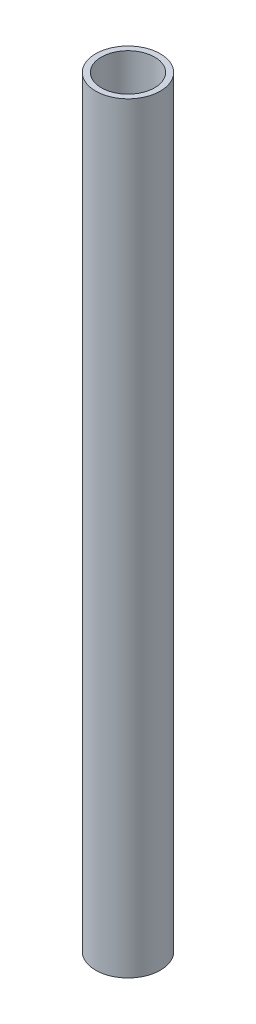
ISO-10303-21;
HEADER;
FILE_DESCRIPTION(('STEP AP214'),'2;1');
FILE_NAME('part.step','',(''),(''),'','','');
FILE_SCHEMA(('AUTOMOTIVE_DESIGN { 1 0 10303 214 1 1 1 1 }'));
ENDSEC;
DATA;
#1=APPLICATION_CONTEXT('core data for automotive mechanical design processes');
#2=APPLICATION_PROTOCOL_DEFINITION('international standard','automotive_design',2000,#1);
#3=PRODUCT_CONTEXT('',#1,'mechanical');
#4=PRODUCT('Part','Part','',(#3));
#5=PRODUCT_RELATED_PRODUCT_CATEGORY('part','',(#4));
#6=PRODUCT_DEFINITION_FORMATION('','',#4);
#7=PRODUCT_DEFINITION_CONTEXT('part definition',#1,'design');
#8=PRODUCT_DEFINITION('design','',#6,#7);
#9=PRODUCT_DEFINITION_SHAPE('','',#8);
#10=(LENGTH_UNIT() NAMED_UNIT(*) SI_UNIT(.MILLI.,.METRE.));
#11=(NAMED_UNIT(*) PLANE_ANGLE_UNIT() SI_UNIT($,.RADIAN.));
#12=(NAMED_UNIT(*) SI_UNIT($,.STERADIAN.) SOLID_ANGLE_UNIT());
#13=UNCERTAINTY_MEASURE_WITH_UNIT(LENGTH_MEASURE(1.E-05),#10,'distance_accuracy_value','');
#14=(GEOMETRIC_REPRESENTATION_CONTEXT(3) GLOBAL_UNCERTAINTY_ASSIGNED_CONTEXT((#13)) GLOBAL_UNIT_ASSIGNED_CONTEXT((#10,
#11,#12)) REPRESENTATION_CONTEXT('',''));
#15=CARTESIAN_POINT('',(0.,0.,0.));
#16=DIRECTION('',(0.,0.,1.));
#17=DIRECTION('',(1.,0.,0.));
#18=AXIS2_PLACEMENT_3D('',#15,#16,#17);
#19=CARTESIAN_POINT('',(0.,400.,0.));
#20=DIRECTION('',(0.,1.,0.));
#21=DIRECTION('',(0.,0.,1.));
#22=AXIS2_PLACEMENT_3D('',#19,#20,#21);
#23=PLANE('',#22);
#24=CARTESIAN_POINT('',(0.,400.,0.));
#25=DIRECTION('',(0.,1.,0.));
#26=DIRECTION('',(0.,0.,1.));
#27=AXIS2_PLACEMENT_3D('',#24,#25,#26);
#28=CIRCLE('',#27,17.);
#29=CARTESIAN_POINT('',(0.,400.,17.));
#30=VERTEX_POINT('',#29);
#31=EDGE_CURVE('E11',#30,#30,#28,.T.);
#32=ORIENTED_EDGE('',*,*,#31,.T.);
#33=EDGE_LOOP('',(#32));
#34=FACE_BOUND('',#33,.T.);
#35=CARTESIAN_POINT('',(0.,400.,0.));
#36=DIRECTION('',(0.,1.,0.));
#37=DIRECTION('',(1.,0.,0.));
#38=AXIS2_PLACEMENT_3D('',#35,#36,#37);
#39=CIRCLE('',#38,14.);
#40=CARTESIAN_POINT('',(14.,400.,0.));
#41=VERTEX_POINT('',#40);
#42=EDGE_CURVE('E50',#41,#41,#39,.T.);
#43=ORIENTED_EDGE('',*,*,#42,.F.);
#44=EDGE_LOOP('',(#43));
#45=FACE_BOUND('',#44,.T.);
#46=ADVANCED_FACE('F39',(#34,#45),#23,.T.);
#47=CARTESIAN_POINT('',(0.,0.,0.));
#48=DIRECTION('',(0.,1.,0.));
#49=DIRECTION('',(0.,0.,1.));
#50=AXIS2_PLACEMENT_3D('',#47,#48,#49);
#51=PLANE('',#50);
#52=CARTESIAN_POINT('',(0.,0.,0.));
#53=DIRECTION('',(0.,1.,0.));
#54=DIRECTION('',(0.,0.,1.));
#55=AXIS2_PLACEMENT_3D('',#52,#53,#54);
#56=CIRCLE('',#55,17.);
#57=CARTESIAN_POINT('',(0.,0.,17.));
#58=VERTEX_POINT('',#57);
#59=EDGE_CURVE('E43',#58,#58,#56,.T.);
#60=ORIENTED_EDGE('',*,*,#59,.F.);
#61=EDGE_LOOP('',(#60));
#62=FACE_BOUND('',#61,.T.);
#63=CARTESIAN_POINT('',(0.,0.,0.));
#64=DIRECTION('',(0.,1.,0.));
#65=DIRECTION('',(1.,0.,0.));
#66=AXIS2_PLACEMENT_3D('',#63,#64,#65);
#67=CIRCLE('',#66,14.);
#68=CARTESIAN_POINT('',(14.,0.,0.));
#69=VERTEX_POINT('',#68);
#70=EDGE_CURVE('E52',#69,#69,#67,.T.);
#71=ORIENTED_EDGE('',*,*,#70,.T.);
#72=EDGE_LOOP('',(#71));
#73=FACE_BOUND('',#72,.T.);
#74=ADVANCED_FACE('F62',(#62,#73),#51,.F.);
#75=CARTESIAN_POINT('',(0.,400.,0.));
#76=DIRECTION('',(0.,-1.,0.));
#77=DIRECTION('',(0.,0.,-1.));
#78=AXIS2_PLACEMENT_3D('',#75,#76,#77);
#79=CYLINDRICAL_SURFACE('',#78,17.);
#80=ORIENTED_EDGE('',*,*,#31,.F.);
#81=EDGE_LOOP('',(#80));
#82=FACE_BOUND('',#81,.T.);
#83=ORIENTED_EDGE('',*,*,#59,.T.);
#84=EDGE_LOOP('',(#83));
#85=FACE_BOUND('',#84,.T.);
#86=ADVANCED_FACE('F41',(#82,#85),#79,.T.);
#87=CARTESIAN_POINT('',(0.,400.,0.));
#88=DIRECTION('',(0.,-1.,0.));
#89=DIRECTION('',(0.,0.,-1.));
#90=AXIS2_PLACEMENT_3D('',#87,#88,#89);
#91=CYLINDRICAL_SURFACE('',#90,14.);
#92=ORIENTED_EDGE('',*,*,#42,.T.);
#93=EDGE_LOOP('',(#92));
#94=FACE_BOUND('',#93,.T.);
#95=ORIENTED_EDGE('',*,*,#70,.F.);
#96=EDGE_LOOP('',(#95));
#97=FACE_BOUND('',#96,.T.);
#98=ADVANCED_FACE('F58',(#94,#97),#91,.F.);
#99=CLOSED_SHELL('',(#46,#74,#86,#98));
#100=MANIFOLD_SOLID_BREP('B2',#99);
#101=ADVANCED_BREP_SHAPE_REPRESENTATION('',(#18,#100),#14);
#102=SHAPE_DEFINITION_REPRESENTATION(#9,#101);
ENDSEC;
END-ISO-10303-21;
